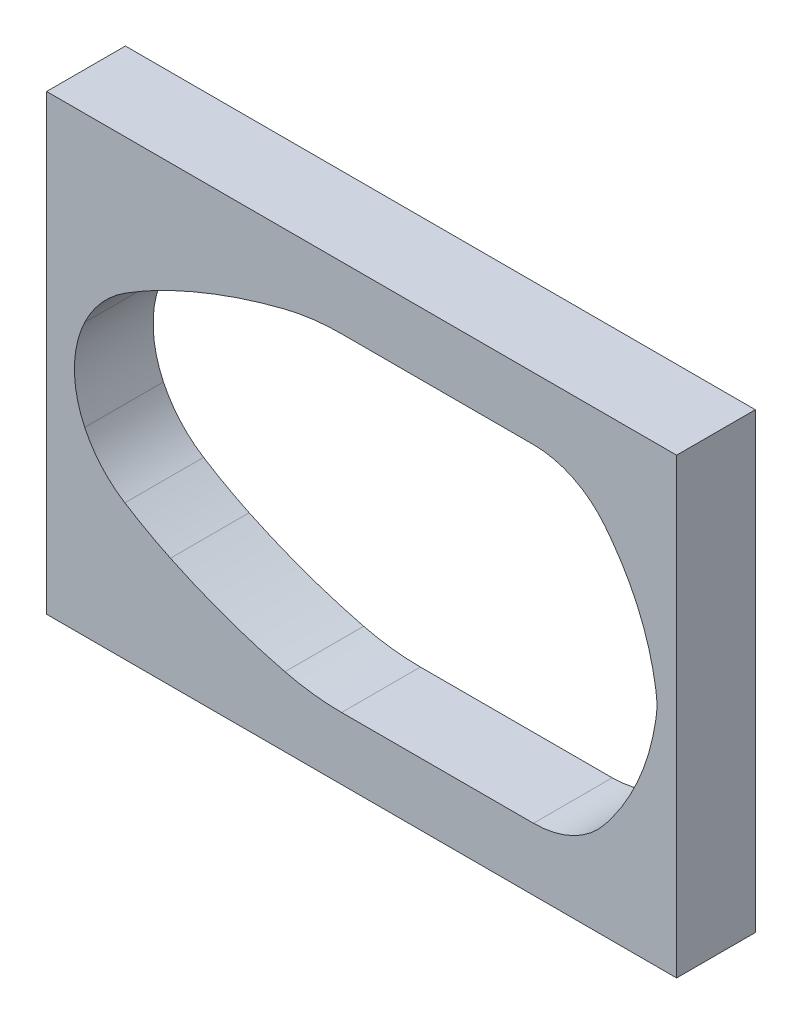
ISO-10303-21;
HEADER;
FILE_DESCRIPTION(('STEP AP214'),'2;1');
FILE_NAME('part.step','',(''),(''),'','','');
FILE_SCHEMA(('AUTOMOTIVE_DESIGN { 1 0 10303 214 1 1 1 1 }'));
ENDSEC;
DATA;
#1=APPLICATION_CONTEXT('core data for automotive mechanical design processes');
#2=APPLICATION_PROTOCOL_DEFINITION('international standard','automotive_design',2000,#1);
#3=PRODUCT_CONTEXT('',#1,'mechanical');
#4=PRODUCT('Part','Part','',(#3));
#5=PRODUCT_RELATED_PRODUCT_CATEGORY('part','',(#4));
#6=PRODUCT_DEFINITION_FORMATION('','',#4);
#7=PRODUCT_DEFINITION_CONTEXT('part definition',#1,'design');
#8=PRODUCT_DEFINITION('design','',#6,#7);
#9=PRODUCT_DEFINITION_SHAPE('','',#8);
#10=(LENGTH_UNIT() NAMED_UNIT(*) SI_UNIT(.MILLI.,.METRE.));
#11=(NAMED_UNIT(*) PLANE_ANGLE_UNIT() SI_UNIT($,.RADIAN.));
#12=(NAMED_UNIT(*) SI_UNIT($,.STERADIAN.) SOLID_ANGLE_UNIT());
#13=UNCERTAINTY_MEASURE_WITH_UNIT(LENGTH_MEASURE(1.E-05),#10,'distance_accuracy_value','');
#14=(GEOMETRIC_REPRESENTATION_CONTEXT(3) GLOBAL_UNCERTAINTY_ASSIGNED_CONTEXT((#13)) GLOBAL_UNIT_ASSIGNED_CONTEXT((#10,
#11,#12)) REPRESENTATION_CONTEXT('',''));
#15=CARTESIAN_POINT('',(0.,0.,0.));
#16=DIRECTION('',(0.,0.,1.));
#17=DIRECTION('',(1.,0.,0.));
#18=AXIS2_PLACEMENT_3D('',#15,#16,#17);
#19=CARTESIAN_POINT('',(-65.3402872127548,130.099092220106,20.));
#20=DIRECTION('',(1.,0.,0.));
#21=DIRECTION('',(0.,1.,0.));
#22=AXIS2_PLACEMENT_3D('',#19,#20,#21);
#23=PLANE('',#22);
#24=CARTESIAN_POINT('',(-65.3402872127548,25.099092220106,10.));
#25=DIRECTION('',(1.,0.,0.));
#26=DIRECTION('',(0.,1.,0.));
#27=AXIS2_PLACEMENT_3D('',#24,#25,#26);
#28=CIRCLE('',#27,5.5);
#29=CARTESIAN_POINT('',(-65.3402872127548,30.599092220106,10.));
#30=VERTEX_POINT('',#29);
#31=EDGE_CURVE('E40',#30,#30,#28,.T.);
#32=ORIENTED_EDGE('',*,*,#31,.T.);
#33=EDGE_LOOP('',(#32));
#34=FACE_BOUND('',#33,.T.);
#35=CARTESIAN_POINT('',(-65.3402872127548,40.099092220106,10.));
#36=DIRECTION('',(1.,0.,0.));
#37=DIRECTION('',(0.,1.,0.));
#38=AXIS2_PLACEMENT_3D('',#35,#36,#37);
#39=CIRCLE('',#38,5.5);
#40=CARTESIAN_POINT('',(-65.3402872127548,45.599092220106,10.));
#41=VERTEX_POINT('',#40);
#42=EDGE_CURVE('E378',#41,#41,#39,.T.);
#43=ORIENTED_EDGE('',*,*,#42,.T.);
#44=EDGE_LOOP('',(#43));
#45=FACE_BOUND('',#44,.T.);
#46=DIRECTION('',(0.,-1.,0.));
#47=VECTOR('',#46,1.);
#48=CARTESIAN_POINT('',(-65.3402872127548,130.099092220106,0.));
#49=LINE('',#48,#47);
#50=CARTESIAN_POINT('',(-65.3402872127548,130.099092220106,0.));
#51=VERTEX_POINT('',#50);
#52=CARTESIAN_POINT('',(-65.3402872127548,15.099092220106,0.));
#53=VERTEX_POINT('',#52);
#54=EDGE_CURVE('E356',#51,#53,#49,.T.);
#55=ORIENTED_EDGE('',*,*,#54,.T.);
#56=DIRECTION('',(0.,0.,-1.));
#57=VECTOR('',#56,1.);
#58=CARTESIAN_POINT('',(-65.3402872127548,15.099092220106,20.));
#59=LINE('',#58,#57);
#60=CARTESIAN_POINT('',(-65.3402872127548,15.099092220106,20.));
#61=VERTEX_POINT('',#60);
#62=EDGE_CURVE('E45',#61,#53,#59,.T.);
#63=ORIENTED_EDGE('',*,*,#62,.F.);
#64=DIRECTION('',(0.,-1.,0.));
#65=VECTOR('',#64,1.);
#66=CARTESIAN_POINT('',(-65.3402872127548,130.099092220106,20.));
#67=LINE('',#66,#65);
#68=CARTESIAN_POINT('',(-65.3402872127548,130.099092220106,20.));
#69=VERTEX_POINT('',#68);
#70=EDGE_CURVE('E361',#69,#61,#67,.T.);
#71=ORIENTED_EDGE('',*,*,#70,.F.);
#72=DIRECTION('',(0.,0.,-1.));
#73=VECTOR('',#72,1.);
#74=CARTESIAN_POINT('',(-65.3402872127548,130.099092220106,20.));
#75=LINE('',#74,#73);
#76=EDGE_CURVE('E11',#69,#51,#75,.T.);
#77=ORIENTED_EDGE('',*,*,#76,.T.);
#78=EDGE_LOOP('',(#55,#63,#71,#77));
#79=FACE_BOUND('',#78,.T.);
#80=CARTESIAN_POINT('',(-65.3402872127548,105.099092220106,10.));
#81=DIRECTION('',(1.,0.,0.));
#82=DIRECTION('',(0.,1.,0.));
#83=AXIS2_PLACEMENT_3D('',#80,#81,#82);
#84=CIRCLE('',#83,5.5);
#85=CARTESIAN_POINT('',(-65.3402872127548,110.599092220106,10.));
#86=VERTEX_POINT('',#85);
#87=EDGE_CURVE('E381',#86,#86,#84,.F.);
#88=ORIENTED_EDGE('',*,*,#87,.F.);
#89=EDGE_LOOP('',(#88));
#90=FACE_BOUND('',#89,.T.);
#91=CARTESIAN_POINT('',(-65.3402872127548,120.099092220106,10.));
#92=DIRECTION('',(1.,0.,0.));
#93=DIRECTION('',(0.,1.,0.));
#94=AXIS2_PLACEMENT_3D('',#91,#92,#93);
#95=CIRCLE('',#94,5.5);
#96=CARTESIAN_POINT('',(-65.3402872127548,125.599092220106,10.));
#97=VERTEX_POINT('',#96);
#98=EDGE_CURVE('E384',#97,#97,#95,.F.);
#99=ORIENTED_EDGE('',*,*,#98,.F.);
#100=EDGE_LOOP('',(#99));
#101=FACE_BOUND('',#100,.T.);
#102=ADVANCED_FACE('F36',(#34,#45,#79,#90,#101),#23,.F.);
#103=CARTESIAN_POINT('',(-65.3402872127548,130.099092220106,20.));
#104=DIRECTION('',(0.,1.,0.));
#105=DIRECTION('',(0.,0.,1.));
#106=AXIS2_PLACEMENT_3D('',#103,#104,#105);
#107=PLANE('',#106);
#108=DIRECTION('',(1.,0.,0.));
#109=VECTOR('',#108,1.);
#110=CARTESIAN_POINT('',(-65.3402872127548,130.099092220106,0.));
#111=LINE('',#110,#109);
#112=CARTESIAN_POINT('',(94.6597127872452,130.099092220106,0.));
#113=VERTEX_POINT('',#112);
#114=EDGE_CURVE('E214',#51,#113,#111,.T.);
#115=ORIENTED_EDGE('',*,*,#114,.F.);
#116=ORIENTED_EDGE('',*,*,#76,.F.);
#117=DIRECTION('',(1.,0.,0.));
#118=VECTOR('',#117,1.);
#119=CARTESIAN_POINT('',(-65.3402872127548,130.099092220106,20.));
#120=LINE('',#119,#118);
#121=CARTESIAN_POINT('',(94.6597127872452,130.099092220106,20.));
#122=VERTEX_POINT('',#121);
#123=EDGE_CURVE('E352',#69,#122,#120,.T.);
#124=ORIENTED_EDGE('',*,*,#123,.T.);
#125=DIRECTION('',(0.,0.,-1.));
#126=VECTOR('',#125,1.);
#127=CARTESIAN_POINT('',(94.6597127872452,130.099092220106,20.));
#128=LINE('',#127,#126);
#129=EDGE_CURVE('E363',#122,#113,#128,.T.);
#130=ORIENTED_EDGE('',*,*,#129,.T.);
#131=EDGE_LOOP('',(#115,#116,#124,#130));
#132=FACE_BOUND('',#131,.T.);
#133=ADVANCED_FACE('F38',(#132),#107,.T.);
#134=CARTESIAN_POINT('',(-65.3402872127548,15.099092220106,20.));
#135=DIRECTION('',(0.,1.,0.));
#136=DIRECTION('',(0.,0.,1.));
#137=AXIS2_PLACEMENT_3D('',#134,#135,#136);
#138=PLANE('',#137);
#139=DIRECTION('',(1.,0.,0.));
#140=VECTOR('',#139,1.);
#141=CARTESIAN_POINT('',(-65.3402872127548,15.099092220106,0.));
#142=LINE('',#141,#140);
#143=CARTESIAN_POINT('',(94.6597127872452,15.099092220106,0.));
#144=VERTEX_POINT('',#143);
#145=EDGE_CURVE('E369',#53,#144,#142,.T.);
#146=ORIENTED_EDGE('',*,*,#145,.T.);
#147=DIRECTION('',(0.,0.,-1.));
#148=VECTOR('',#147,1.);
#149=CARTESIAN_POINT('',(94.6597127872452,15.099092220106,20.));
#150=LINE('',#149,#148);
#151=CARTESIAN_POINT('',(94.6597127872452,15.099092220106,20.));
#152=VERTEX_POINT('',#151);
#153=EDGE_CURVE('E375',#152,#144,#150,.T.);
#154=ORIENTED_EDGE('',*,*,#153,.F.);
#155=DIRECTION('',(1.,0.,0.));
#156=VECTOR('',#155,1.);
#157=CARTESIAN_POINT('',(-65.3402872127548,15.099092220106,20.));
#158=LINE('',#157,#156);
#159=EDGE_CURVE('E359',#61,#152,#158,.T.);
#160=ORIENTED_EDGE('',*,*,#159,.F.);
#161=ORIENTED_EDGE('',*,*,#62,.T.);
#162=EDGE_LOOP('',(#146,#154,#160,#161));
#163=FACE_BOUND('',#162,.T.);
#164=ADVANCED_FACE('F414',(#163),#138,.F.);
#165=CARTESIAN_POINT('',(94.6597127872452,130.099092220106,20.));
#166=DIRECTION('',(1.,0.,0.));
#167=DIRECTION('',(0.,0.,-1.));
#168=AXIS2_PLACEMENT_3D('',#165,#166,#167);
#169=PLANE('',#168);
#170=DIRECTION('',(0.,-1.,0.));
#171=VECTOR('',#170,1.);
#172=CARTESIAN_POINT('',(94.6597127872452,130.099092220106,0.));
#173=LINE('',#172,#171);
#174=EDGE_CURVE('E366',#113,#144,#173,.T.);
#175=ORIENTED_EDGE('',*,*,#174,.F.);
#176=ORIENTED_EDGE('',*,*,#129,.F.);
#177=DIRECTION('',(0.,-1.,0.));
#178=VECTOR('',#177,1.);
#179=CARTESIAN_POINT('',(94.6597127872452,130.099092220106,20.));
#180=LINE('',#179,#178);
#181=EDGE_CURVE('E355',#122,#152,#180,.T.);
#182=ORIENTED_EDGE('',*,*,#181,.T.);
#183=ORIENTED_EDGE('',*,*,#153,.T.);
#184=EDGE_LOOP('',(#175,#176,#182,#183));
#185=FACE_BOUND('',#184,.T.);
#186=ADVANCED_FACE('F421',(#185),#169,.T.);
#187=CARTESIAN_POINT('',(0.,0.,20.));
#188=DIRECTION('',(0.,0.,-1.));
#189=DIRECTION('',(-1.,0.,0.));
#190=AXIS2_PLACEMENT_3D('',#187,#188,#189);
#191=PLANE('',#190);
#192=CARTESIAN_POINT('',(-31.4401550554803,72.5990922201059,20.));
#193=DIRECTION('',(0.,0.,1.));
#194=DIRECTION('',(1.,0.,0.));
#195=AXIS2_PLACEMENT_3D('',#192,#193,#194);
#196=CIRCLE('',#195,26.8521823698711);
#197=CARTESIAN_POINT('',(-55.6776194430504,84.1569907352379,20.));
#198=VERTEX_POINT('',#197);
#199=CARTESIAN_POINT('',(-55.6776194430504,61.0411937049742,20.));
#200=VERTEX_POINT('',#199);
#201=EDGE_CURVE('E198',#198,#200,#196,.T.);
#202=ORIENTED_EDGE('',*,*,#201,.F.);
#203=CARTESIAN_POINT('',(-30.6332251871006,72.2142989356919,20.));
#204=DIRECTION('',(0.,0.,1.));
#205=DIRECTION('',(1.,0.,0.));
#206=AXIS2_PLACEMENT_3D('',#203,#204,#205);
#207=CIRCLE('',#206,27.7461631773907);
#208=CARTESIAN_POINT('',(-45.481740165845,95.6529672850755,20.));
#209=VERTEX_POINT('',#208);
#210=EDGE_CURVE('E258',#209,#198,#207,.T.);
#211=ORIENTED_EDGE('',*,*,#210,.F.);
#212=CARTESIAN_POINT('',(13.2691370229803,2.91357027227871,20.));
#213=DIRECTION('',(0.,0.,1.));
#214=DIRECTION('',(-1.,0.,0.));
#215=AXIS2_PLACEMENT_3D('',#212,#213,#214);
#216=CIRCLE('',#215,109.782791587542);
#217=CARTESIAN_POINT('',(-33.9003523111456,102.046312616629,20.));
#218=VERTEX_POINT('',#217);
#219=EDGE_CURVE('E256',#218,#209,#216,.T.);
#220=ORIENTED_EDGE('',*,*,#219,.F.);
#221=CARTESIAN_POINT('',(32.6395727186546,-37.7958891266776,20.));
#222=DIRECTION('',(0.,0.,1.));
#223=DIRECTION('',(-1.,0.,0.));
#224=AXIS2_PLACEMENT_3D('',#221,#222,#223);
#225=CIRCLE('',#224,154.865758033812);
#226=CARTESIAN_POINT('',(-4.81796767836734,112.471657864656,20.));
#227=VERTEX_POINT('',#226);
#228=EDGE_CURVE('E254',#227,#218,#225,.T.);
#229=ORIENTED_EDGE('',*,*,#228,.F.);
#230=CARTESIAN_POINT('',(9.58215438629937,54.7030218010536,20.));
#231=DIRECTION('',(0.,0.,1.));
#232=DIRECTION('',(-1.,0.,0.));
#233=AXIS2_PLACEMENT_3D('',#230,#231,#232);
#234=CIRCLE('',#233,59.5363655938639);
#235=CARTESIAN_POINT('',(9.58215438629937,114.239387394918,20.));
#236=VERTEX_POINT('',#235);
#237=EDGE_CURVE('E252',#236,#227,#234,.T.);
#238=ORIENTED_EDGE('',*,*,#237,.F.);
#239=DIRECTION('',(-1.,0.,0.));
#240=VECTOR('',#239,1.);
#241=CARTESIAN_POINT('',(58.3022524463827,114.239387394917,20.));
#242=LINE('',#241,#240);
#243=CARTESIAN_POINT('',(58.3022524463827,114.239387394917,20.));
#244=VERTEX_POINT('',#243);
#245=EDGE_CURVE('E250',#244,#236,#242,.T.);
#246=ORIENTED_EDGE('',*,*,#245,.F.);
#247=CARTESIAN_POINT('',(58.3022524463827,91.1712430520947,20.));
#248=DIRECTION('',(0.,0.,1.));
#249=DIRECTION('',(-1.,0.,0.));
#250=AXIS2_PLACEMENT_3D('',#247,#248,#249);
#251=CIRCLE('',#250,23.0681443428229);
#252=CARTESIAN_POINT('',(76.3981893999671,105.477757274406,20.));
#253=VERTEX_POINT('',#252);
#254=EDGE_CURVE('E248',#253,#244,#251,.T.);
#255=ORIENTED_EDGE('',*,*,#254,.F.);
#256=CARTESIAN_POINT('',(10.4589133602433,53.346652215246,20.));
#257=DIRECTION('',(0.,0.,1.));
#258=DIRECTION('',(-1.,0.,0.));
#259=AXIS2_PLACEMENT_3D('',#256,#257,#258);
#260=CIRCLE('',#259,84.0573627907284);
#261=CARTESIAN_POINT('',(78.3508909483691,102.907923572078,20.));
#262=VERTEX_POINT('',#261);
#263=EDGE_CURVE('E246',#262,#253,#260,.T.);
#264=ORIENTED_EDGE('',*,*,#263,.F.);
#265=CARTESIAN_POINT('',(29.3855116191473,67.163104548715,20.));
#266=DIRECTION('',(0.,0.,1.));
#267=DIRECTION('',(-1.,0.,0.));
#268=AXIS2_PLACEMENT_3D('',#265,#266,#267);
#269=CIRCLE('',#268,60.624256365481);
#270=CARTESIAN_POINT('',(89.3434295794089,76.1268389121427,20.));
#271=VERTEX_POINT('',#270);
#272=EDGE_CURVE('E244',#271,#262,#269,.T.);
#273=ORIENTED_EDGE('',*,*,#272,.F.);
#274=DIRECTION('',(-0.147857225817152,0.989008716227342,0.));
#275=VECTOR('',#274,1.);
#276=CARTESIAN_POINT('',(89.343429579409,76.1268389121427,20.));
#277=LINE('',#276,#275);
#278=CARTESIAN_POINT('',(89.4509167973212,75.40786292155,20.));
#279=VERTEX_POINT('',#278);
#280=EDGE_CURVE('E242',#279,#271,#277,.T.);
#281=ORIENTED_EDGE('',*,*,#280,.F.);
#282=CARTESIAN_POINT('',(70.6632066244933,72.599092220106,20.));
#283=DIRECTION('',(0.,0.,1.));
#284=DIRECTION('',(-1.,0.,0.));
#285=AXIS2_PLACEMENT_3D('',#282,#283,#284);
#286=CIRCLE('',#285,18.9965061627519);
#287=CARTESIAN_POINT('',(89.4509167973213,69.7903215186631,20.));
#288=VERTEX_POINT('',#287);
#289=EDGE_CURVE('E240',#288,#279,#286,.T.);
#290=ORIENTED_EDGE('',*,*,#289,.F.);
#291=DIRECTION('',(0.147857225817149,0.989008716227343,0.));
#292=VECTOR('',#291,1.);
#293=CARTESIAN_POINT('',(89.343429579409,69.0713455280692,20.));
#294=LINE('',#293,#292);
#295=CARTESIAN_POINT('',(89.343429579409,69.0713455280692,20.));
#296=VERTEX_POINT('',#295);
#297=EDGE_CURVE('E238',#296,#288,#294,.T.);
#298=ORIENTED_EDGE('',*,*,#297,.F.);
#299=CARTESIAN_POINT('',(29.3855116191473,78.0350798914969,20.));
#300=DIRECTION('',(0.,0.,1.));
#301=DIRECTION('',(1.,0.,0.));
#302=AXIS2_PLACEMENT_3D('',#299,#300,#301);
#303=CIRCLE('',#302,60.624256365481);
#304=CARTESIAN_POINT('',(78.3508909483691,42.2902608681338,20.));
#305=VERTEX_POINT('',#304);
#306=EDGE_CURVE('E236',#305,#296,#303,.T.);
#307=ORIENTED_EDGE('',*,*,#306,.F.);
#308=CARTESIAN_POINT('',(10.4589133602433,91.8515322249659,20.));
#309=DIRECTION('',(0.,0.,1.));
#310=DIRECTION('',(1.,0.,0.));
#311=AXIS2_PLACEMENT_3D('',#308,#309,#310);
#312=CIRCLE('',#311,84.0573627907284);
#313=CARTESIAN_POINT('',(76.3981893999672,39.7204271658055,20.));
#314=VERTEX_POINT('',#313);
#315=EDGE_CURVE('E234',#314,#305,#312,.T.);
#316=ORIENTED_EDGE('',*,*,#315,.F.);
#317=CARTESIAN_POINT('',(58.3022524463827,54.0269413881173,20.));
#318=DIRECTION('',(0.,0.,1.));
#319=DIRECTION('',(1.,0.,0.));
#320=AXIS2_PLACEMENT_3D('',#317,#318,#319);
#321=CIRCLE('',#320,23.0681443428229);
#322=CARTESIAN_POINT('',(58.3022524463827,30.9587970452944,20.));
#323=VERTEX_POINT('',#322);
#324=EDGE_CURVE('E232',#323,#314,#321,.T.);
#325=ORIENTED_EDGE('',*,*,#324,.F.);
#326=DIRECTION('',(1.,0.,0.));
#327=VECTOR('',#326,1.);
#328=CARTESIAN_POINT('',(9.58215438629937,30.9587970452944,20.));
#329=LINE('',#328,#327);
#330=CARTESIAN_POINT('',(9.58215438629937,30.9587970452944,20.));
#331=VERTEX_POINT('',#330);
#332=EDGE_CURVE('E230',#331,#323,#329,.T.);
#333=ORIENTED_EDGE('',*,*,#332,.F.);
#334=CARTESIAN_POINT('',(9.58215438629937,90.4951626391584,20.));
#335=DIRECTION('',(0.,0.,1.));
#336=DIRECTION('',(1.,0.,0.));
#337=AXIS2_PLACEMENT_3D('',#334,#335,#336);
#338=CIRCLE('',#337,59.536365593864);
#339=CARTESIAN_POINT('',(-4.81796767836734,32.7265265755562,20.));
#340=VERTEX_POINT('',#339);
#341=EDGE_CURVE('E228',#340,#331,#338,.T.);
#342=ORIENTED_EDGE('',*,*,#341,.F.);
#343=CARTESIAN_POINT('',(32.6395727186546,182.99407356689,20.));
#344=DIRECTION('',(0.,0.,1.));
#345=DIRECTION('',(1.,0.,0.));
#346=AXIS2_PLACEMENT_3D('',#343,#344,#345);
#347=CIRCLE('',#346,154.865758033812);
#348=CARTESIAN_POINT('',(-33.9003523111456,43.1518718235828,20.));
#349=VERTEX_POINT('',#348);
#350=EDGE_CURVE('E223',#349,#340,#347,.T.);
#351=ORIENTED_EDGE('',*,*,#350,.F.);
#352=CARTESIAN_POINT('',(13.2691370229803,142.284614167933,20.));
#353=DIRECTION('',(0.,0.,1.));
#354=DIRECTION('',(1.,0.,0.));
#355=AXIS2_PLACEMENT_3D('',#352,#353,#354);
#356=CIRCLE('',#355,109.782791587542);
#357=CARTESIAN_POINT('',(-45.4817401658451,49.5452171551365,20.));
#358=VERTEX_POINT('',#357);
#359=EDGE_CURVE('E221',#358,#349,#356,.T.);
#360=ORIENTED_EDGE('',*,*,#359,.F.);
#361=CARTESIAN_POINT('',(-30.6332251871006,72.9838855045201,20.));
#362=DIRECTION('',(0.,0.,1.));
#363=DIRECTION('',(-1.,0.,0.));
#364=AXIS2_PLACEMENT_3D('',#361,#362,#363);
#365=CIRCLE('',#364,27.7461631773907);
#366=EDGE_CURVE('E206',#200,#358,#365,.T.);
#367=ORIENTED_EDGE('',*,*,#366,.F.);
#368=EDGE_LOOP('',(#202,#211,#220,#229,#238,#246,#255,#264,#273,#281,#290,#298,#307,#316,#325,
#333,#342,#351,#360,#367));
#369=FACE_BOUND('',#368,.T.);
#370=ORIENTED_EDGE('',*,*,#123,.F.);
#371=ORIENTED_EDGE('',*,*,#70,.T.);
#372=ORIENTED_EDGE('',*,*,#159,.T.);
#373=ORIENTED_EDGE('',*,*,#181,.F.);
#374=EDGE_LOOP('',(#370,#371,#372,#373));
#375=FACE_BOUND('',#374,.T.);
#376=ADVANCED_FACE('F218',(#369,#375),#191,.F.);
#377=CARTESIAN_POINT('',(0.,0.,0.));
#378=DIRECTION('',(0.,0.,-1.));
#379=DIRECTION('',(-1.,0.,0.));
#380=AXIS2_PLACEMENT_3D('',#377,#378,#379);
#381=PLANE('',#380);
#382=CARTESIAN_POINT('',(-30.6332251871006,72.2142989356919,0.));
#383=DIRECTION('',(0.,0.,1.));
#384=DIRECTION('',(1.,0.,0.));
#385=AXIS2_PLACEMENT_3D('',#382,#383,#384);
#386=CIRCLE('',#385,27.7461631773907);
#387=CARTESIAN_POINT('',(-45.481740165845,95.6529672850755,0.));
#388=VERTEX_POINT('',#387);
#389=CARTESIAN_POINT('',(-55.6776194430504,84.1569907352379,0.));
#390=VERTEX_POINT('',#389);
#391=EDGE_CURVE('E207',#388,#390,#386,.T.);
#392=ORIENTED_EDGE('',*,*,#391,.T.);
#393=CARTESIAN_POINT('',(-31.4401550554803,72.5990922201059,0.));
#394=DIRECTION('',(0.,0.,1.));
#395=DIRECTION('',(1.,0.,0.));
#396=AXIS2_PLACEMENT_3D('',#393,#394,#395);
#397=CIRCLE('',#396,26.8521823698711);
#398=CARTESIAN_POINT('',(-55.6776194430504,61.0411937049742,0.));
#399=VERTEX_POINT('',#398);
#400=EDGE_CURVE('E61',#390,#399,#397,.T.);
#401=ORIENTED_EDGE('',*,*,#400,.T.);
#402=CARTESIAN_POINT('',(-30.6332251871006,72.9838855045201,0.));
#403=DIRECTION('',(0.,0.,1.));
#404=DIRECTION('',(-1.,0.,0.));
#405=AXIS2_PLACEMENT_3D('',#402,#403,#404);
#406=CIRCLE('',#405,27.7461631773907);
#407=CARTESIAN_POINT('',(-45.4817401658451,49.5452171551365,0.));
#408=VERTEX_POINT('',#407);
#409=EDGE_CURVE('E213',#399,#408,#406,.T.);
#410=ORIENTED_EDGE('',*,*,#409,.T.);
#411=CARTESIAN_POINT('',(13.2691370229803,142.284614167933,0.));
#412=DIRECTION('',(0.,0.,1.));
#413=DIRECTION('',(1.,0.,0.));
#414=AXIS2_PLACEMENT_3D('',#411,#412,#413);
#415=CIRCLE('',#414,109.782791587542);
#416=CARTESIAN_POINT('',(-33.9003523111456,43.1518718235828,0.));
#417=VERTEX_POINT('',#416);
#418=EDGE_CURVE('E262',#408,#417,#415,.T.);
#419=ORIENTED_EDGE('',*,*,#418,.T.);
#420=CARTESIAN_POINT('',(32.6395727186546,182.99407356689,0.));
#421=DIRECTION('',(0.,0.,1.));
#422=DIRECTION('',(1.,0.,0.));
#423=AXIS2_PLACEMENT_3D('',#420,#421,#422);
#424=CIRCLE('',#423,154.865758033812);
#425=CARTESIAN_POINT('',(-4.81796767836734,32.7265265755562,0.));
#426=VERTEX_POINT('',#425);
#427=EDGE_CURVE('E265',#417,#426,#424,.T.);
#428=ORIENTED_EDGE('',*,*,#427,.T.);
#429=CARTESIAN_POINT('',(9.58215438629937,90.4951626391584,0.));
#430=DIRECTION('',(0.,0.,1.));
#431=DIRECTION('',(1.,0.,0.));
#432=AXIS2_PLACEMENT_3D('',#429,#430,#431);
#433=CIRCLE('',#432,59.536365593864);
#434=CARTESIAN_POINT('',(9.58215438629937,30.9587970452944,0.));
#435=VERTEX_POINT('',#434);
#436=EDGE_CURVE('E268',#426,#435,#433,.T.);
#437=ORIENTED_EDGE('',*,*,#436,.T.);
#438=DIRECTION('',(1.,0.,0.));
#439=VECTOR('',#438,1.);
#440=CARTESIAN_POINT('',(58.3022524463827,30.9587970452944,0.));
#441=LINE('',#440,#439);
#442=CARTESIAN_POINT('',(58.3022524463827,30.9587970452944,0.));
#443=VERTEX_POINT('',#442);
#444=EDGE_CURVE('E271',#435,#443,#441,.T.);
#445=ORIENTED_EDGE('',*,*,#444,.T.);
#446=CARTESIAN_POINT('',(58.3022524463827,54.0269413881173,0.));
#447=DIRECTION('',(0.,0.,1.));
#448=DIRECTION('',(1.,0.,0.));
#449=AXIS2_PLACEMENT_3D('',#446,#447,#448);
#450=CIRCLE('',#449,23.0681443428229);
#451=CARTESIAN_POINT('',(76.3981893999672,39.7204271658055,0.));
#452=VERTEX_POINT('',#451);
#453=EDGE_CURVE('E274',#443,#452,#450,.T.);
#454=ORIENTED_EDGE('',*,*,#453,.T.);
#455=CARTESIAN_POINT('',(10.4589133602433,91.8515322249659,0.));
#456=DIRECTION('',(0.,0.,1.));
#457=DIRECTION('',(1.,0.,0.));
#458=AXIS2_PLACEMENT_3D('',#455,#456,#457);
#459=CIRCLE('',#458,84.0573627907284);
#460=CARTESIAN_POINT('',(78.3508909483691,42.2902608681338,0.));
#461=VERTEX_POINT('',#460);
#462=EDGE_CURVE('E277',#452,#461,#459,.T.);
#463=ORIENTED_EDGE('',*,*,#462,.T.);
#464=CARTESIAN_POINT('',(29.3855116191473,78.0350798914969,0.));
#465=DIRECTION('',(0.,0.,1.));
#466=DIRECTION('',(1.,0.,0.));
#467=AXIS2_PLACEMENT_3D('',#464,#465,#466);
#468=CIRCLE('',#467,60.624256365481);
#469=CARTESIAN_POINT('',(89.343429579409,69.0713455280692,0.));
#470=VERTEX_POINT('',#469);
#471=EDGE_CURVE('E280',#461,#470,#468,.T.);
#472=ORIENTED_EDGE('',*,*,#471,.T.);
#473=DIRECTION('',(0.147857225817149,0.989008716227343,0.));
#474=VECTOR('',#473,1.);
#475=CARTESIAN_POINT('',(89.343429579409,69.0713455280692,0.));
#476=LINE('',#475,#474);
#477=CARTESIAN_POINT('',(89.4509167973213,69.7903215186631,0.));
#478=VERTEX_POINT('',#477);
#479=EDGE_CURVE('E283',#470,#478,#476,.T.);
#480=ORIENTED_EDGE('',*,*,#479,.T.);
#481=CARTESIAN_POINT('',(70.6632066244933,72.599092220106,0.));
#482=DIRECTION('',(0.,0.,1.));
#483=DIRECTION('',(-1.,0.,0.));
#484=AXIS2_PLACEMENT_3D('',#481,#482,#483);
#485=CIRCLE('',#484,18.9965061627519);
#486=CARTESIAN_POINT('',(89.4509167973212,75.40786292155,0.));
#487=VERTEX_POINT('',#486);
#488=EDGE_CURVE('E286',#478,#487,#485,.T.);
#489=ORIENTED_EDGE('',*,*,#488,.T.);
#490=DIRECTION('',(-0.147857225817152,0.989008716227342,0.));
#491=VECTOR('',#490,1.);
#492=CARTESIAN_POINT('',(89.343429579409,76.1268389121427,0.));
#493=LINE('',#492,#491);
#494=CARTESIAN_POINT('',(89.3434295794089,76.1268389121427,0.));
#495=VERTEX_POINT('',#494);
#496=EDGE_CURVE('E289',#487,#495,#493,.T.);
#497=ORIENTED_EDGE('',*,*,#496,.T.);
#498=CARTESIAN_POINT('',(29.3855116191473,67.163104548715,0.));
#499=DIRECTION('',(0.,0.,1.));
#500=DIRECTION('',(-1.,0.,0.));
#501=AXIS2_PLACEMENT_3D('',#498,#499,#500);
#502=CIRCLE('',#501,60.624256365481);
#503=CARTESIAN_POINT('',(78.3508909483691,102.907923572078,0.));
#504=VERTEX_POINT('',#503);
#505=EDGE_CURVE('E292',#495,#504,#502,.T.);
#506=ORIENTED_EDGE('',*,*,#505,.T.);
#507=CARTESIAN_POINT('',(10.4589133602433,53.346652215246,0.));
#508=DIRECTION('',(0.,0.,1.));
#509=DIRECTION('',(-1.,0.,0.));
#510=AXIS2_PLACEMENT_3D('',#507,#508,#509);
#511=CIRCLE('',#510,84.0573627907284);
#512=CARTESIAN_POINT('',(76.3981893999671,105.477757274406,0.));
#513=VERTEX_POINT('',#512);
#514=EDGE_CURVE('E295',#504,#513,#511,.T.);
#515=ORIENTED_EDGE('',*,*,#514,.T.);
#516=CARTESIAN_POINT('',(58.3022524463827,91.1712430520947,0.));
#517=DIRECTION('',(0.,0.,1.));
#518=DIRECTION('',(-1.,0.,0.));
#519=AXIS2_PLACEMENT_3D('',#516,#517,#518);
#520=CIRCLE('',#519,23.0681443428229);
#521=CARTESIAN_POINT('',(58.3022524463827,114.239387394917,0.));
#522=VERTEX_POINT('',#521);
#523=EDGE_CURVE('E298',#513,#522,#520,.T.);
#524=ORIENTED_EDGE('',*,*,#523,.T.);
#525=DIRECTION('',(-1.,0.,0.));
#526=VECTOR('',#525,1.);
#527=CARTESIAN_POINT('',(9.58215438629937,114.239387394918,0.));
#528=LINE('',#527,#526);
#529=CARTESIAN_POINT('',(9.58215438629937,114.239387394918,0.));
#530=VERTEX_POINT('',#529);
#531=EDGE_CURVE('E301',#522,#530,#528,.T.);
#532=ORIENTED_EDGE('',*,*,#531,.T.);
#533=CARTESIAN_POINT('',(9.58215438629937,54.7030218010536,0.));
#534=DIRECTION('',(0.,0.,1.));
#535=DIRECTION('',(-1.,0.,0.));
#536=AXIS2_PLACEMENT_3D('',#533,#534,#535);
#537=CIRCLE('',#536,59.5363655938639);
#538=CARTESIAN_POINT('',(-4.81796767836734,112.471657864656,0.));
#539=VERTEX_POINT('',#538);
#540=EDGE_CURVE('E304',#530,#539,#537,.T.);
#541=ORIENTED_EDGE('',*,*,#540,.T.);
#542=CARTESIAN_POINT('',(32.6395727186546,-37.7958891266776,0.));
#543=DIRECTION('',(0.,0.,1.));
#544=DIRECTION('',(-1.,0.,0.));
#545=AXIS2_PLACEMENT_3D('',#542,#543,#544);
#546=CIRCLE('',#545,154.865758033812);
#547=CARTESIAN_POINT('',(-33.9003523111456,102.046312616629,0.));
#548=VERTEX_POINT('',#547);
#549=EDGE_CURVE('E307',#539,#548,#546,.T.);
#550=ORIENTED_EDGE('',*,*,#549,.T.);
#551=CARTESIAN_POINT('',(13.2691370229803,2.91357027227871,0.));
#552=DIRECTION('',(0.,0.,1.));
#553=DIRECTION('',(-1.,0.,0.));
#554=AXIS2_PLACEMENT_3D('',#551,#552,#553);
#555=CIRCLE('',#554,109.782791587542);
#556=EDGE_CURVE('E310',#548,#388,#555,.T.);
#557=ORIENTED_EDGE('',*,*,#556,.T.);
#558=EDGE_LOOP('',(#392,#401,#410,#419,#428,#437,#445,#454,#463,#472,#480,#489,#497,#506,#515,
#524,#532,#541,#550,#557));
#559=FACE_BOUND('',#558,.T.);
#560=ORIENTED_EDGE('',*,*,#114,.T.);
#561=ORIENTED_EDGE('',*,*,#174,.T.);
#562=ORIENTED_EDGE('',*,*,#145,.F.);
#563=ORIENTED_EDGE('',*,*,#54,.F.);
#564=EDGE_LOOP('',(#560,#561,#562,#563));
#565=FACE_BOUND('',#564,.T.);
#566=ADVANCED_FACE('F418',(#559,#565),#381,.T.);
#567=CARTESIAN_POINT('',(-31.4401550554803,72.5990922201059,20.));
#568=DIRECTION('',(0.,0.,-1.));
#569=DIRECTION('',(-1.,0.,0.));
#570=AXIS2_PLACEMENT_3D('',#567,#568,#569);
#571=CYLINDRICAL_SURFACE('',#570,26.8521823698711);
#572=ORIENTED_EDGE('',*,*,#400,.F.);
#573=DIRECTION('',(0.,0.,-1.));
#574=VECTOR('',#573,1.);
#575=CARTESIAN_POINT('',(-55.6776194430504,84.1569907352379,20.));
#576=LINE('',#575,#574);
#577=EDGE_CURVE('E202',#198,#390,#576,.T.);
#578=ORIENTED_EDGE('',*,*,#577,.F.);
#579=ORIENTED_EDGE('',*,*,#201,.T.);
#580=DIRECTION('',(0.,0.,-1.));
#581=VECTOR('',#580,1.);
#582=CARTESIAN_POINT('',(-55.6776194430504,61.0411937049742,20.));
#583=LINE('',#582,#581);
#584=EDGE_CURVE('E201',#200,#399,#583,.T.);
#585=ORIENTED_EDGE('',*,*,#584,.T.);
#586=EDGE_LOOP('',(#572,#578,#579,#585));
#587=FACE_BOUND('',#586,.T.);
#588=ADVANCED_FACE('F200',(#587),#571,.F.);
#589=CARTESIAN_POINT('',(-30.6332251871006,72.9838855045201,20.));
#590=DIRECTION('',(0.,0.,-1.));
#591=DIRECTION('',(-1.,0.,0.));
#592=AXIS2_PLACEMENT_3D('',#589,#590,#591);
#593=CYLINDRICAL_SURFACE('',#592,27.7461631773907);
#594=ORIENTED_EDGE('',*,*,#409,.F.);
#595=ORIENTED_EDGE('',*,*,#584,.F.);
#596=ORIENTED_EDGE('',*,*,#366,.T.);
#597=DIRECTION('',(0.,0.,-1.));
#598=VECTOR('',#597,1.);
#599=CARTESIAN_POINT('',(-45.4817401658451,49.5452171551365,20.));
#600=LINE('',#599,#598);
#601=EDGE_CURVE('E215',#358,#408,#600,.T.);
#602=ORIENTED_EDGE('',*,*,#601,.T.);
#603=EDGE_LOOP('',(#594,#595,#596,#602));
#604=FACE_BOUND('',#603,.T.);
#605=ADVANCED_FACE('F210',(#604),#593,.F.);
#606=CARTESIAN_POINT('',(13.2691370229803,142.284614167933,20.));
#607=DIRECTION('',(0.,0.,-1.));
#608=DIRECTION('',(-1.,0.,0.));
#609=AXIS2_PLACEMENT_3D('',#606,#607,#608);
#610=CYLINDRICAL_SURFACE('',#609,109.782791587542);
#611=ORIENTED_EDGE('',*,*,#418,.F.);
#612=ORIENTED_EDGE('',*,*,#601,.F.);
#613=ORIENTED_EDGE('',*,*,#359,.T.);
#614=DIRECTION('',(0.,0.,-1.));
#615=VECTOR('',#614,1.);
#616=CARTESIAN_POINT('',(-33.9003523111456,43.1518718235828,20.));
#617=LINE('',#616,#615);
#618=EDGE_CURVE('E349',#349,#417,#617,.T.);
#619=ORIENTED_EDGE('',*,*,#618,.T.);
#620=EDGE_LOOP('',(#611,#612,#613,#619));
#621=FACE_BOUND('',#620,.T.);
#622=ADVANCED_FACE('F550',(#621),#610,.F.);
#623=CARTESIAN_POINT('',(32.6395727186546,182.99407356689,20.));
#624=DIRECTION('',(0.,0.,-1.));
#625=DIRECTION('',(-1.,0.,0.));
#626=AXIS2_PLACEMENT_3D('',#623,#624,#625);
#627=CYLINDRICAL_SURFACE('',#626,154.865758033812);
#628=ORIENTED_EDGE('',*,*,#427,.F.);
#629=ORIENTED_EDGE('',*,*,#618,.F.);
#630=ORIENTED_EDGE('',*,*,#350,.T.);
#631=DIRECTION('',(0.,0.,-1.));
#632=VECTOR('',#631,1.);
#633=CARTESIAN_POINT('',(-4.81796767836734,32.7265265755562,20.));
#634=LINE('',#633,#632);
#635=EDGE_CURVE('E347',#340,#426,#634,.T.);
#636=ORIENTED_EDGE('',*,*,#635,.T.);
#637=EDGE_LOOP('',(#628,#629,#630,#636));
#638=FACE_BOUND('',#637,.T.);
#639=ADVANCED_FACE('F546',(#638),#627,.F.);
#640=CARTESIAN_POINT('',(9.58215438629937,90.4951626391584,20.));
#641=DIRECTION('',(0.,0.,-1.));
#642=DIRECTION('',(-1.,0.,0.));
#643=AXIS2_PLACEMENT_3D('',#640,#641,#642);
#644=CYLINDRICAL_SURFACE('',#643,59.536365593864);
#645=ORIENTED_EDGE('',*,*,#436,.F.);
#646=ORIENTED_EDGE('',*,*,#635,.F.);
#647=ORIENTED_EDGE('',*,*,#341,.T.);
#648=DIRECTION('',(0.,0.,-1.));
#649=VECTOR('',#648,1.);
#650=CARTESIAN_POINT('',(9.58215438629937,30.9587970452944,20.));
#651=LINE('',#650,#649);
#652=EDGE_CURVE('E344',#331,#435,#651,.T.);
#653=ORIENTED_EDGE('',*,*,#652,.T.);
#654=EDGE_LOOP('',(#645,#646,#647,#653));
#655=FACE_BOUND('',#654,.T.);
#656=ADVANCED_FACE('F542',(#655),#644,.F.);
#657=CARTESIAN_POINT('',(58.3022524463827,30.9587970452944,20.));
#658=DIRECTION('',(0.,1.,0.));
#659=DIRECTION('',(0.,0.,1.));
#660=AXIS2_PLACEMENT_3D('',#657,#658,#659);
#661=PLANE('',#660);
#662=ORIENTED_EDGE('',*,*,#444,.F.);
#663=ORIENTED_EDGE('',*,*,#652,.F.);
#664=ORIENTED_EDGE('',*,*,#332,.T.);
#665=DIRECTION('',(0.,0.,-1.));
#666=VECTOR('',#665,1.);
#667=CARTESIAN_POINT('',(58.3022524463827,30.9587970452944,20.));
#668=LINE('',#667,#666);
#669=EDGE_CURVE('E342',#323,#443,#668,.T.);
#670=ORIENTED_EDGE('',*,*,#669,.T.);
#671=EDGE_LOOP('',(#662,#663,#664,#670));
#672=FACE_BOUND('',#671,.T.);
#673=ADVANCED_FACE('F538',(#672),#661,.T.);
#674=CARTESIAN_POINT('',(58.3022524463827,54.0269413881173,20.));
#675=DIRECTION('',(0.,0.,-1.));
#676=DIRECTION('',(-1.,0.,0.));
#677=AXIS2_PLACEMENT_3D('',#674,#675,#676);
#678=CYLINDRICAL_SURFACE('',#677,23.0681443428229);
#679=ORIENTED_EDGE('',*,*,#453,.F.);
#680=ORIENTED_EDGE('',*,*,#669,.F.);
#681=ORIENTED_EDGE('',*,*,#324,.T.);
#682=DIRECTION('',(0.,0.,-1.));
#683=VECTOR('',#682,1.);
#684=CARTESIAN_POINT('',(76.3981893999672,39.7204271658055,20.));
#685=LINE('',#684,#683);
#686=EDGE_CURVE('E340',#314,#452,#685,.T.);
#687=ORIENTED_EDGE('',*,*,#686,.T.);
#688=EDGE_LOOP('',(#679,#680,#681,#687));
#689=FACE_BOUND('',#688,.T.);
#690=ADVANCED_FACE('F534',(#689),#678,.F.);
#691=CARTESIAN_POINT('',(10.4589133602433,91.8515322249659,20.));
#692=DIRECTION('',(0.,0.,-1.));
#693=DIRECTION('',(-1.,0.,0.));
#694=AXIS2_PLACEMENT_3D('',#691,#692,#693);
#695=CYLINDRICAL_SURFACE('',#694,84.0573627907284);
#696=ORIENTED_EDGE('',*,*,#462,.F.);
#697=ORIENTED_EDGE('',*,*,#686,.F.);
#698=ORIENTED_EDGE('',*,*,#315,.T.);
#699=DIRECTION('',(0.,0.,-1.));
#700=VECTOR('',#699,1.);
#701=CARTESIAN_POINT('',(78.3508909483691,42.2902608681338,20.));
#702=LINE('',#701,#700);
#703=EDGE_CURVE('E338',#305,#461,#702,.T.);
#704=ORIENTED_EDGE('',*,*,#703,.T.);
#705=EDGE_LOOP('',(#696,#697,#698,#704));
#706=FACE_BOUND('',#705,.T.);
#707=ADVANCED_FACE('F530',(#706),#695,.F.);
#708=CARTESIAN_POINT('',(29.3855116191473,78.0350798914969,20.));
#709=DIRECTION('',(0.,0.,-1.));
#710=DIRECTION('',(-1.,0.,0.));
#711=AXIS2_PLACEMENT_3D('',#708,#709,#710);
#712=CYLINDRICAL_SURFACE('',#711,60.624256365481);
#713=ORIENTED_EDGE('',*,*,#471,.F.);
#714=ORIENTED_EDGE('',*,*,#703,.F.);
#715=ORIENTED_EDGE('',*,*,#306,.T.);
#716=DIRECTION('',(0.,0.,-1.));
#717=VECTOR('',#716,1.);
#718=CARTESIAN_POINT('',(89.343429579409,69.0713455280692,20.));
#719=LINE('',#718,#717);
#720=EDGE_CURVE('E336',#296,#470,#719,.T.);
#721=ORIENTED_EDGE('',*,*,#720,.T.);
#722=EDGE_LOOP('',(#713,#714,#715,#721));
#723=FACE_BOUND('',#722,.T.);
#724=ADVANCED_FACE('F526',(#723),#712,.F.);
#725=CARTESIAN_POINT('',(89.343429579409,69.0713455280692,20.));
#726=DIRECTION('',(-0.989008716227343,0.147857225817149,0.));
#727=DIRECTION('',(-0.147857225817149,-0.989008716227343,0.));
#728=AXIS2_PLACEMENT_3D('',#725,#726,#727);
#729=PLANE('',#728);
#730=ORIENTED_EDGE('',*,*,#479,.F.);
#731=ORIENTED_EDGE('',*,*,#720,.F.);
#732=ORIENTED_EDGE('',*,*,#297,.T.);
#733=DIRECTION('',(0.,0.,-1.));
#734=VECTOR('',#733,1.);
#735=CARTESIAN_POINT('',(89.4509167973213,69.7903215186631,20.));
#736=LINE('',#735,#734);
#737=EDGE_CURVE('E334',#288,#478,#736,.T.);
#738=ORIENTED_EDGE('',*,*,#737,.T.);
#739=EDGE_LOOP('',(#730,#731,#732,#738));
#740=FACE_BOUND('',#739,.T.);
#741=ADVANCED_FACE('F522',(#740),#729,.T.);
#742=CARTESIAN_POINT('',(70.6632066244933,72.599092220106,20.));
#743=DIRECTION('',(0.,0.,-1.));
#744=DIRECTION('',(-1.,0.,0.));
#745=AXIS2_PLACEMENT_3D('',#742,#743,#744);
#746=CYLINDRICAL_SURFACE('',#745,18.9965061627519);
#747=ORIENTED_EDGE('',*,*,#488,.F.);
#748=ORIENTED_EDGE('',*,*,#737,.F.);
#749=ORIENTED_EDGE('',*,*,#289,.T.);
#750=DIRECTION('',(0.,0.,-1.));
#751=VECTOR('',#750,1.);
#752=CARTESIAN_POINT('',(89.4509167973212,75.40786292155,20.));
#753=LINE('',#752,#751);
#754=EDGE_CURVE('E332',#279,#487,#753,.T.);
#755=ORIENTED_EDGE('',*,*,#754,.T.);
#756=EDGE_LOOP('',(#747,#748,#749,#755));
#757=FACE_BOUND('',#756,.T.);
#758=ADVANCED_FACE('F518',(#757),#746,.F.);
#759=CARTESIAN_POINT('',(89.343429579409,76.1268389121427,20.));
#760=DIRECTION('',(-0.989008716227342,-0.147857225817152,0.));
#761=DIRECTION('',(0.147857225817152,-0.989008716227342,0.));
#762=AXIS2_PLACEMENT_3D('',#759,#760,#761);
#763=PLANE('',#762);
#764=ORIENTED_EDGE('',*,*,#496,.F.);
#765=ORIENTED_EDGE('',*,*,#754,.F.);
#766=ORIENTED_EDGE('',*,*,#280,.T.);
#767=DIRECTION('',(0.,0.,-1.));
#768=VECTOR('',#767,1.);
#769=CARTESIAN_POINT('',(89.3434295794089,76.1268389121427,20.));
#770=LINE('',#769,#768);
#771=EDGE_CURVE('E330',#271,#495,#770,.T.);
#772=ORIENTED_EDGE('',*,*,#771,.T.);
#773=EDGE_LOOP('',(#764,#765,#766,#772));
#774=FACE_BOUND('',#773,.T.);
#775=ADVANCED_FACE('F514',(#774),#763,.T.);
#776=CARTESIAN_POINT('',(29.3855116191473,67.163104548715,20.));
#777=DIRECTION('',(0.,0.,-1.));
#778=DIRECTION('',(-1.,0.,0.));
#779=AXIS2_PLACEMENT_3D('',#776,#777,#778);
#780=CYLINDRICAL_SURFACE('',#779,60.624256365481);
#781=ORIENTED_EDGE('',*,*,#505,.F.);
#782=ORIENTED_EDGE('',*,*,#771,.F.);
#783=ORIENTED_EDGE('',*,*,#272,.T.);
#784=DIRECTION('',(0.,0.,-1.));
#785=VECTOR('',#784,1.);
#786=CARTESIAN_POINT('',(78.3508909483691,102.907923572078,20.));
#787=LINE('',#786,#785);
#788=EDGE_CURVE('E328',#262,#504,#787,.T.);
#789=ORIENTED_EDGE('',*,*,#788,.T.);
#790=EDGE_LOOP('',(#781,#782,#783,#789));
#791=FACE_BOUND('',#790,.T.);
#792=ADVANCED_FACE('F510',(#791),#780,.F.);
#793=CARTESIAN_POINT('',(10.4589133602433,53.346652215246,20.));
#794=DIRECTION('',(0.,0.,-1.));
#795=DIRECTION('',(-1.,0.,0.));
#796=AXIS2_PLACEMENT_3D('',#793,#794,#795);
#797=CYLINDRICAL_SURFACE('',#796,84.0573627907284);
#798=ORIENTED_EDGE('',*,*,#514,.F.);
#799=ORIENTED_EDGE('',*,*,#788,.F.);
#800=ORIENTED_EDGE('',*,*,#263,.T.);
#801=DIRECTION('',(0.,0.,-1.));
#802=VECTOR('',#801,1.);
#803=CARTESIAN_POINT('',(76.3981893999671,105.477757274406,20.));
#804=LINE('',#803,#802);
#805=EDGE_CURVE('E326',#253,#513,#804,.T.);
#806=ORIENTED_EDGE('',*,*,#805,.T.);
#807=EDGE_LOOP('',(#798,#799,#800,#806));
#808=FACE_BOUND('',#807,.T.);
#809=ADVANCED_FACE('F506',(#808),#797,.F.);
#810=CARTESIAN_POINT('',(58.3022524463827,91.1712430520947,20.));
#811=DIRECTION('',(0.,0.,-1.));
#812=DIRECTION('',(-1.,0.,0.));
#813=AXIS2_PLACEMENT_3D('',#810,#811,#812);
#814=CYLINDRICAL_SURFACE('',#813,23.0681443428229);
#815=ORIENTED_EDGE('',*,*,#523,.F.);
#816=ORIENTED_EDGE('',*,*,#805,.F.);
#817=ORIENTED_EDGE('',*,*,#254,.T.);
#818=DIRECTION('',(0.,0.,-1.));
#819=VECTOR('',#818,1.);
#820=CARTESIAN_POINT('',(58.3022524463827,114.239387394917,20.));
#821=LINE('',#820,#819);
#822=EDGE_CURVE('E323',#244,#522,#821,.T.);
#823=ORIENTED_EDGE('',*,*,#822,.T.);
#824=EDGE_LOOP('',(#815,#816,#817,#823));
#825=FACE_BOUND('',#824,.T.);
#826=ADVANCED_FACE('F502',(#825),#814,.F.);
#827=CARTESIAN_POINT('',(9.58215438629937,114.239387394918,20.));
#828=DIRECTION('',(0.,-1.,0.));
#829=DIRECTION('',(0.,0.,-1.));
#830=AXIS2_PLACEMENT_3D('',#827,#828,#829);
#831=PLANE('',#830);
#832=ORIENTED_EDGE('',*,*,#531,.F.);
#833=ORIENTED_EDGE('',*,*,#822,.F.);
#834=ORIENTED_EDGE('',*,*,#245,.T.);
#835=DIRECTION('',(0.,0.,-1.));
#836=VECTOR('',#835,1.);
#837=CARTESIAN_POINT('',(9.58215438629937,114.239387394918,20.));
#838=LINE('',#837,#836);
#839=EDGE_CURVE('E321',#236,#530,#838,.T.);
#840=ORIENTED_EDGE('',*,*,#839,.T.);
#841=EDGE_LOOP('',(#832,#833,#834,#840));
#842=FACE_BOUND('',#841,.T.);
#843=ADVANCED_FACE('F498',(#842),#831,.T.);
#844=CARTESIAN_POINT('',(9.58215438629937,54.7030218010536,20.));
#845=DIRECTION('',(0.,0.,-1.));
#846=DIRECTION('',(-1.,0.,0.));
#847=AXIS2_PLACEMENT_3D('',#844,#845,#846);
#848=CYLINDRICAL_SURFACE('',#847,59.5363655938639);
#849=ORIENTED_EDGE('',*,*,#540,.F.);
#850=ORIENTED_EDGE('',*,*,#839,.F.);
#851=ORIENTED_EDGE('',*,*,#237,.T.);
#852=DIRECTION('',(0.,0.,-1.));
#853=VECTOR('',#852,1.);
#854=CARTESIAN_POINT('',(-4.81796767836734,112.471657864656,20.));
#855=LINE('',#854,#853);
#856=EDGE_CURVE('E319',#227,#539,#855,.T.);
#857=ORIENTED_EDGE('',*,*,#856,.T.);
#858=EDGE_LOOP('',(#849,#850,#851,#857));
#859=FACE_BOUND('',#858,.T.);
#860=ADVANCED_FACE('F494',(#859),#848,.F.);
#861=CARTESIAN_POINT('',(32.6395727186546,-37.7958891266776,20.));
#862=DIRECTION('',(0.,0.,-1.));
#863=DIRECTION('',(-1.,0.,0.));
#864=AXIS2_PLACEMENT_3D('',#861,#862,#863);
#865=CYLINDRICAL_SURFACE('',#864,154.865758033812);
#866=ORIENTED_EDGE('',*,*,#549,.F.);
#867=ORIENTED_EDGE('',*,*,#856,.F.);
#868=ORIENTED_EDGE('',*,*,#228,.T.);
#869=DIRECTION('',(0.,0.,-1.));
#870=VECTOR('',#869,1.);
#871=CARTESIAN_POINT('',(-33.9003523111456,102.046312616629,20.));
#872=LINE('',#871,#870);
#873=EDGE_CURVE('E317',#218,#548,#872,.T.);
#874=ORIENTED_EDGE('',*,*,#873,.T.);
#875=EDGE_LOOP('',(#866,#867,#868,#874));
#876=FACE_BOUND('',#875,.T.);
#877=ADVANCED_FACE('F490',(#876),#865,.F.);
#878=CARTESIAN_POINT('',(13.2691370229803,2.91357027227871,20.));
#879=DIRECTION('',(0.,0.,-1.));
#880=DIRECTION('',(-1.,0.,0.));
#881=AXIS2_PLACEMENT_3D('',#878,#879,#880);
#882=CYLINDRICAL_SURFACE('',#881,109.782791587542);
#883=ORIENTED_EDGE('',*,*,#556,.F.);
#884=ORIENTED_EDGE('',*,*,#873,.F.);
#885=ORIENTED_EDGE('',*,*,#219,.T.);
#886=DIRECTION('',(0.,0.,-1.));
#887=VECTOR('',#886,1.);
#888=CARTESIAN_POINT('',(-45.481740165845,95.6529672850755,20.));
#889=LINE('',#888,#887);
#890=EDGE_CURVE('E53',#209,#388,#889,.T.);
#891=ORIENTED_EDGE('',*,*,#890,.T.);
#892=EDGE_LOOP('',(#883,#884,#885,#891));
#893=FACE_BOUND('',#892,.T.);
#894=ADVANCED_FACE('F485',(#893),#882,.F.);
#895=CARTESIAN_POINT('',(-30.6332251871006,72.2142989356919,20.));
#896=DIRECTION('',(0.,0.,-1.));
#897=DIRECTION('',(-1.,0.,0.));
#898=AXIS2_PLACEMENT_3D('',#895,#896,#897);
#899=CYLINDRICAL_SURFACE('',#898,27.7461631773907);
#900=ORIENTED_EDGE('',*,*,#391,.F.);
#901=ORIENTED_EDGE('',*,*,#890,.F.);
#902=ORIENTED_EDGE('',*,*,#210,.T.);
#903=ORIENTED_EDGE('',*,*,#577,.T.);
#904=EDGE_LOOP('',(#900,#901,#902,#903));
#905=FACE_BOUND('',#904,.T.);
#906=ADVANCED_FACE('F479',(#905),#899,.F.);
#907=CARTESIAN_POINT('',(-51.2,40.099092220106,10.));
#908=DIRECTION('',(-1.,0.,0.));
#909=DIRECTION('',(0.,0.,1.));
#910=AXIS2_PLACEMENT_3D('',#907,#908,#909);
#911=CYLINDRICAL_SURFACE('',#910,5.5);
#912=CARTESIAN_POINT('',(-51.2,40.099092220106,10.));
#913=DIRECTION('',(-1.,0.,0.));
#914=DIRECTION('',(0.,0.,1.));
#915=AXIS2_PLACEMENT_3D('',#912,#913,#914);
#916=CIRCLE('',#915,5.5);
#917=CARTESIAN_POINT('',(-51.2,40.099092220106,15.5));
#918=VERTEX_POINT('',#917);
#919=EDGE_CURVE('E382',#918,#918,#916,.T.);
#920=ORIENTED_EDGE('',*,*,#919,.F.);
#921=EDGE_LOOP('',(#920));
#922=FACE_BOUND('',#921,.T.);
#923=ORIENTED_EDGE('',*,*,#42,.F.);
#924=EDGE_LOOP('',(#923));
#925=FACE_BOUND('',#924,.T.);
#926=ADVANCED_FACE('F456',(#922,#925),#911,.F.);
#927=CARTESIAN_POINT('',(-51.2,40.099092220106,10.));
#928=DIRECTION('',(-1.,0.,0.));
#929=DIRECTION('',(0.,0.,1.));
#930=AXIS2_PLACEMENT_3D('',#927,#928,#929);
#931=PLANE('',#930);
#932=ORIENTED_EDGE('',*,*,#919,.T.);
#933=EDGE_LOOP('',(#932));
#934=FACE_BOUND('',#933,.T.);
#935=ADVANCED_FACE('F447',(#934),#931,.T.);
#936=CARTESIAN_POINT('',(-51.2,105.099092220106,10.));
#937=DIRECTION('',(-1.,0.,0.));
#938=DIRECTION('',(0.,0.,1.));
#939=AXIS2_PLACEMENT_3D('',#936,#937,#938);
#940=CYLINDRICAL_SURFACE('',#939,5.5);
#941=CARTESIAN_POINT('',(-51.2,105.099092220106,10.));
#942=DIRECTION('',(1.,0.,0.));
#943=DIRECTION('',(0.,0.,-1.));
#944=AXIS2_PLACEMENT_3D('',#941,#942,#943);
#945=CIRCLE('',#944,5.5);
#946=CARTESIAN_POINT('',(-51.2,105.099092220106,4.50000000000001));
#947=VERTEX_POINT('',#946);
#948=EDGE_CURVE('E468',#947,#947,#945,.T.);
#949=ORIENTED_EDGE('',*,*,#948,.T.);
#950=EDGE_LOOP('',(#949));
#951=FACE_BOUND('',#950,.T.);
#952=ORIENTED_EDGE('',*,*,#87,.T.);
#953=EDGE_LOOP('',(#952));
#954=FACE_BOUND('',#953,.T.);
#955=ADVANCED_FACE('F444',(#951,#954),#940,.F.);
#956=CARTESIAN_POINT('',(-51.2,105.099092220106,10.));
#957=DIRECTION('',(1.,0.,0.));
#958=DIRECTION('',(0.,0.,-1.));
#959=AXIS2_PLACEMENT_3D('',#956,#957,#958);
#960=PLANE('',#959);
#961=ORIENTED_EDGE('',*,*,#948,.F.);
#962=EDGE_LOOP('',(#961));
#963=FACE_BOUND('',#962,.T.);
#964=ADVANCED_FACE('F446',(#963),#960,.F.);
#965=CARTESIAN_POINT('',(-51.2,120.099092220106,10.));
#966=DIRECTION('',(-1.,0.,0.));
#967=DIRECTION('',(0.,0.,1.));
#968=AXIS2_PLACEMENT_3D('',#965,#966,#967);
#969=CYLINDRICAL_SURFACE('',#968,5.5);
#970=CARTESIAN_POINT('',(-51.2,120.099092220106,10.));
#971=DIRECTION('',(1.,0.,0.));
#972=DIRECTION('',(0.,0.,-1.));
#973=AXIS2_PLACEMENT_3D('',#970,#971,#972);
#974=CIRCLE('',#973,5.5);
#975=CARTESIAN_POINT('',(-51.2,120.099092220106,4.50000000000001));
#976=VERTEX_POINT('',#975);
#977=EDGE_CURVE('E467',#976,#976,#974,.T.);
#978=ORIENTED_EDGE('',*,*,#977,.T.);
#979=EDGE_LOOP('',(#978));
#980=FACE_BOUND('',#979,.T.);
#981=ORIENTED_EDGE('',*,*,#98,.T.);
#982=EDGE_LOOP('',(#981));
#983=FACE_BOUND('',#982,.T.);
#984=ADVANCED_FACE('F405',(#980,#983),#969,.F.);
#985=CARTESIAN_POINT('',(-51.2,120.099092220106,10.));
#986=DIRECTION('',(1.,0.,0.));
#987=DIRECTION('',(0.,0.,-1.));
#988=AXIS2_PLACEMENT_3D('',#985,#986,#987);
#989=PLANE('',#988);
#990=ORIENTED_EDGE('',*,*,#977,.F.);
#991=EDGE_LOOP('',(#990));
#992=FACE_BOUND('',#991,.T.);
#993=ADVANCED_FACE('F396',(#992),#989,.F.);
#994=CARTESIAN_POINT('',(-51.2,25.099092220106,10.));
#995=DIRECTION('',(-1.,0.,0.));
#996=DIRECTION('',(0.,0.,1.));
#997=AXIS2_PLACEMENT_3D('',#994,#995,#996);
#998=CYLINDRICAL_SURFACE('',#997,5.5);
#999=CARTESIAN_POINT('',(-51.2,25.099092220106,10.));
#1000=DIRECTION('',(-1.,0.,0.));
#1001=DIRECTION('',(0.,0.,1.));
#1002=AXIS2_PLACEMENT_3D('',#999,#1000,#1001);
#1003=CIRCLE('',#1002,5.5);
#1004=CARTESIAN_POINT('',(-51.2,25.099092220106,15.5));
#1005=VERTEX_POINT('',#1004);
#1006=EDGE_CURVE('E469',#1005,#1005,#1003,.T.);
#1007=ORIENTED_EDGE('',*,*,#1006,.F.);
#1008=EDGE_LOOP('',(#1007));
#1009=FACE_BOUND('',#1008,.T.);
#1010=ORIENTED_EDGE('',*,*,#31,.F.);
#1011=EDGE_LOOP('',(#1010));
#1012=FACE_BOUND('',#1011,.T.);
#1013=ADVANCED_FACE('F393',(#1009,#1012),#998,.F.);
#1014=CARTESIAN_POINT('',(-51.2,25.099092220106,10.));
#1015=DIRECTION('',(-1.,0.,0.));
#1016=DIRECTION('',(0.,0.,1.));
#1017=AXIS2_PLACEMENT_3D('',#1014,#1015,#1016);
#1018=PLANE('',#1017);
#1019=ORIENTED_EDGE('',*,*,#1006,.T.);
#1020=EDGE_LOOP('',(#1019));
#1021=FACE_BOUND('',#1020,.T.);
#1022=ADVANCED_FACE('F395',(#1021),#1018,.T.);
#1023=CLOSED_SHELL('',(#102,#133,#164,#186,#376,#566,#588,#605,#622,#639,#656,#673,#690,#707,
#724,#741,#758,#775,#792,#809,#826,#843,#860,#877,#894,#906,#926,#935,#955,#964,#984,#993,#1013,#1022));
#1024=MANIFOLD_SOLID_BREP('B2',#1023);
#1025=ADVANCED_BREP_SHAPE_REPRESENTATION('',(#18,#1024),#14);
#1026=SHAPE_DEFINITION_REPRESENTATION(#9,#1025);
ENDSEC;
END-ISO-10303-21;
